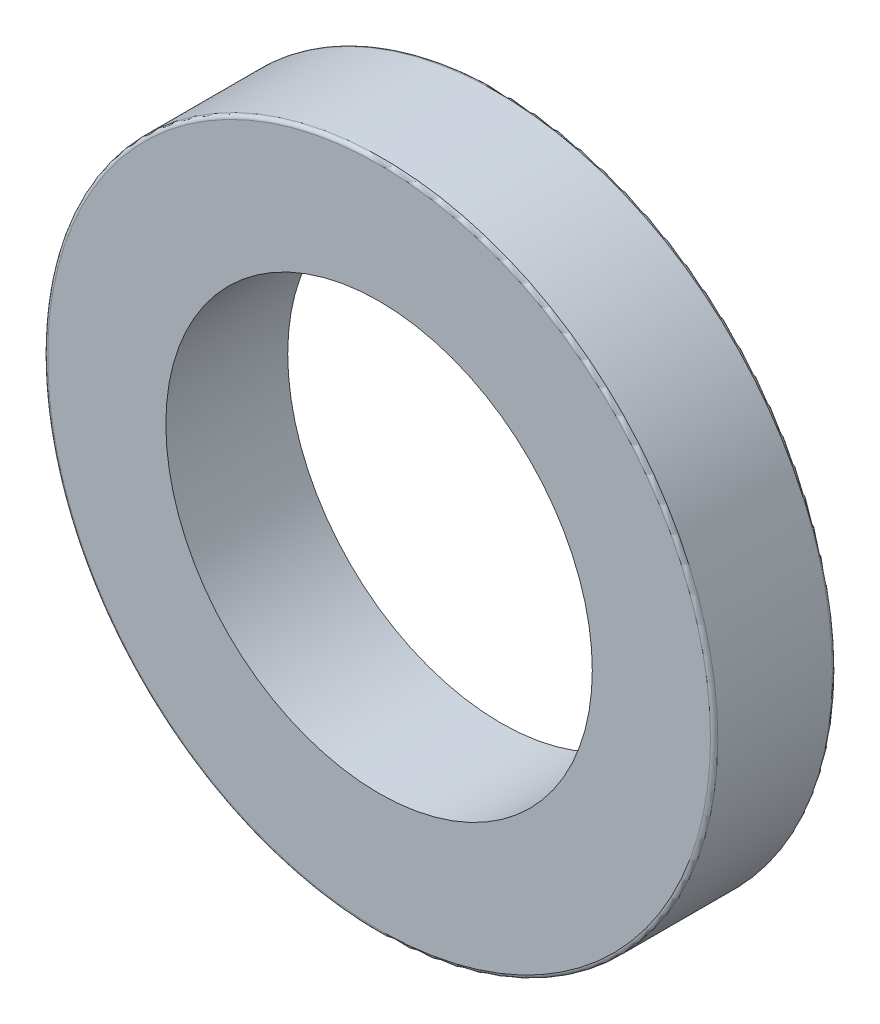
ISO-10303-21;
HEADER;
FILE_DESCRIPTION(('STEP AP214'),'2;1');
FILE_NAME('part.step','',(''),(''),'','','');
FILE_SCHEMA(('AUTOMOTIVE_DESIGN { 1 0 10303 214 1 1 1 1 }'));
ENDSEC;
DATA;
#1=APPLICATION_CONTEXT('core data for automotive mechanical design processes');
#2=APPLICATION_PROTOCOL_DEFINITION('international standard','automotive_design',2000,#1);
#3=PRODUCT_CONTEXT('',#1,'mechanical');
#4=PRODUCT('Part','Part','',(#3));
#5=PRODUCT_RELATED_PRODUCT_CATEGORY('part','',(#4));
#6=PRODUCT_DEFINITION_FORMATION('','',#4);
#7=PRODUCT_DEFINITION_CONTEXT('part definition',#1,'design');
#8=PRODUCT_DEFINITION('design','',#6,#7);
#9=PRODUCT_DEFINITION_SHAPE('','',#8);
#10=(LENGTH_UNIT() NAMED_UNIT(*) SI_UNIT(.MILLI.,.METRE.));
#11=(NAMED_UNIT(*) PLANE_ANGLE_UNIT() SI_UNIT($,.RADIAN.));
#12=(NAMED_UNIT(*) SI_UNIT($,.STERADIAN.) SOLID_ANGLE_UNIT());
#13=UNCERTAINTY_MEASURE_WITH_UNIT(LENGTH_MEASURE(1.E-05),#10,'distance_accuracy_value','');
#14=(GEOMETRIC_REPRESENTATION_CONTEXT(3) GLOBAL_UNCERTAINTY_ASSIGNED_CONTEXT((#13)) GLOBAL_UNIT_ASSIGNED_CONTEXT((#10,
#11,#12)) REPRESENTATION_CONTEXT('',''));
#15=CARTESIAN_POINT('',(0.,0.,0.));
#16=DIRECTION('',(0.,0.,1.));
#17=DIRECTION('',(1.,0.,0.));
#18=AXIS2_PLACEMENT_3D('',#15,#16,#17);
#19=CARTESIAN_POINT('',(0.,0.,10.));
#20=DIRECTION('',(0.,0.,1.));
#21=DIRECTION('',(1.,0.,0.));
#22=AXIS2_PLACEMENT_3D('',#19,#20,#21);
#23=PLANE('',#22);
#24=CARTESIAN_POINT('',(0.,0.,10.));
#25=DIRECTION('',(0.,0.,1.));
#26=DIRECTION('',(1.,0.,0.));
#27=AXIS2_PLACEMENT_3D('',#24,#25,#26);
#28=CIRCLE('',#27,27.2);
#29=CARTESIAN_POINT('',(27.2,0.,10.));
#30=VERTEX_POINT('',#29);
#31=EDGE_CURVE('E10',#30,#30,#28,.T.);
#32=ORIENTED_EDGE('',*,*,#31,.T.);
#33=EDGE_LOOP('',(#32));
#34=FACE_BOUND('',#33,.T.);
#35=CARTESIAN_POINT('',(0.,0.,10.));
#36=DIRECTION('',(0.,0.,1.));
#37=DIRECTION('',(1.,0.,0.));
#38=AXIS2_PLACEMENT_3D('',#35,#36,#37);
#39=CIRCLE('',#38,17.5);
#40=CARTESIAN_POINT('',(17.5,0.,10.));
#41=VERTEX_POINT('',#40);
#42=EDGE_CURVE('E61',#41,#41,#39,.T.);
#43=ORIENTED_EDGE('',*,*,#42,.F.);
#44=EDGE_LOOP('',(#43));
#45=FACE_BOUND('',#44,.T.);
#46=ADVANCED_FACE('F37',(#34,#45),#23,.T.);
#47=CARTESIAN_POINT('',(0.,0.,0.));
#48=DIRECTION('',(0.,0.,1.));
#49=DIRECTION('',(1.,0.,0.));
#50=AXIS2_PLACEMENT_3D('',#47,#48,#49);
#51=PLANE('',#50);
#52=CARTESIAN_POINT('',(0.,0.,0.));
#53=DIRECTION('',(0.,0.,1.));
#54=DIRECTION('',(1.,0.,0.));
#55=AXIS2_PLACEMENT_3D('',#52,#53,#54);
#56=CIRCLE('',#55,27.2);
#57=CARTESIAN_POINT('',(27.2,0.,0.));
#58=VERTEX_POINT('',#57);
#59=EDGE_CURVE('E45',#58,#58,#56,.F.);
#60=ORIENTED_EDGE('',*,*,#59,.T.);
#61=EDGE_LOOP('',(#60));
#62=FACE_BOUND('',#61,.T.);
#63=CARTESIAN_POINT('',(0.,0.,0.));
#64=DIRECTION('',(0.,0.,1.));
#65=DIRECTION('',(1.,0.,0.));
#66=AXIS2_PLACEMENT_3D('',#63,#64,#65);
#67=CIRCLE('',#66,17.5);
#68=CARTESIAN_POINT('',(17.5,0.,0.));
#69=VERTEX_POINT('',#68);
#70=EDGE_CURVE('E62',#69,#69,#67,.T.);
#71=ORIENTED_EDGE('',*,*,#70,.T.);
#72=EDGE_LOOP('',(#71));
#73=FACE_BOUND('',#72,.T.);
#74=ADVANCED_FACE('F74',(#62,#73),#51,.F.);
#75=CARTESIAN_POINT('',(0.,0.,10.));
#76=DIRECTION('',(0.,0.,-1.));
#77=DIRECTION('',(-1.,0.,0.));
#78=AXIS2_PLACEMENT_3D('',#75,#76,#77);
#79=CYLINDRICAL_SURFACE('',#78,27.5);
#80=CARTESIAN_POINT('',(0.,0.,0.3));
#81=DIRECTION('',(0.,0.,1.));
#82=DIRECTION('',(1.,0.,0.));
#83=AXIS2_PLACEMENT_3D('',#80,#81,#82);
#84=CIRCLE('',#83,27.5);
#85=CARTESIAN_POINT('',(27.5,0.,0.3));
#86=VERTEX_POINT('',#85);
#87=EDGE_CURVE('E50',#86,#86,#84,.T.);
#88=ORIENTED_EDGE('',*,*,#87,.T.);
#89=EDGE_LOOP('',(#88));
#90=FACE_BOUND('',#89,.T.);
#91=CARTESIAN_POINT('',(0.,0.,9.7));
#92=DIRECTION('',(0.,0.,1.));
#93=DIRECTION('',(1.,0.,0.));
#94=AXIS2_PLACEMENT_3D('',#91,#92,#93);
#95=CIRCLE('',#94,27.5);
#96=CARTESIAN_POINT('',(27.5,0.,9.7));
#97=VERTEX_POINT('',#96);
#98=EDGE_CURVE('E55',#97,#97,#95,.F.);
#99=ORIENTED_EDGE('',*,*,#98,.T.);
#100=EDGE_LOOP('',(#99));
#101=FACE_BOUND('',#100,.T.);
#102=ADVANCED_FACE('F79',(#90,#101),#79,.T.);
#103=CARTESIAN_POINT('',(0.,0.,10.));
#104=DIRECTION('',(0.,0.,-1.));
#105=DIRECTION('',(-1.,0.,0.));
#106=AXIS2_PLACEMENT_3D('',#103,#104,#105);
#107=CYLINDRICAL_SURFACE('',#106,17.5);
#108=ORIENTED_EDGE('',*,*,#42,.T.);
#109=EDGE_LOOP('',(#108));
#110=FACE_BOUND('',#109,.T.);
#111=ORIENTED_EDGE('',*,*,#70,.F.);
#112=EDGE_LOOP('',(#111));
#113=FACE_BOUND('',#112,.T.);
#114=ADVANCED_FACE('F70',(#110,#113),#107,.F.);
#115=CARTESIAN_POINT('',(0.,0.,0.3));
#116=DIRECTION('',(0.,0.,1.));
#117=DIRECTION('',(1.,0.,0.));
#118=AXIS2_PLACEMENT_3D('',#115,#116,#117);
#119=TOROIDAL_SURFACE('',#118,27.2,0.3);
#120=ORIENTED_EDGE('',*,*,#59,.F.);
#121=EDGE_LOOP('',(#120));
#122=FACE_BOUND('',#121,.T.);
#123=ORIENTED_EDGE('',*,*,#87,.F.);
#124=EDGE_LOOP('',(#123));
#125=FACE_BOUND('',#124,.T.);
#126=ADVANCED_FACE('F85',(#122,#125),#119,.T.);
#127=CARTESIAN_POINT('',(0.,0.,9.7));
#128=DIRECTION('',(0.,0.,1.));
#129=DIRECTION('',(1.,0.,0.));
#130=AXIS2_PLACEMENT_3D('',#127,#128,#129);
#131=TOROIDAL_SURFACE('',#130,27.2,0.3);
#132=ORIENTED_EDGE('',*,*,#98,.F.);
#133=EDGE_LOOP('',(#132));
#134=FACE_BOUND('',#133,.T.);
#135=ORIENTED_EDGE('',*,*,#31,.F.);
#136=EDGE_LOOP('',(#135));
#137=FACE_BOUND('',#136,.T.);
#138=ADVANCED_FACE('F39',(#134,#137),#131,.T.);
#139=CLOSED_SHELL('',(#46,#74,#102,#114,#126,#138));
#140=MANIFOLD_SOLID_BREP('B2',#139);
#141=ADVANCED_BREP_SHAPE_REPRESENTATION('',(#18,#140),#14);
#142=SHAPE_DEFINITION_REPRESENTATION(#9,#141);
ENDSEC;
END-ISO-10303-21;
